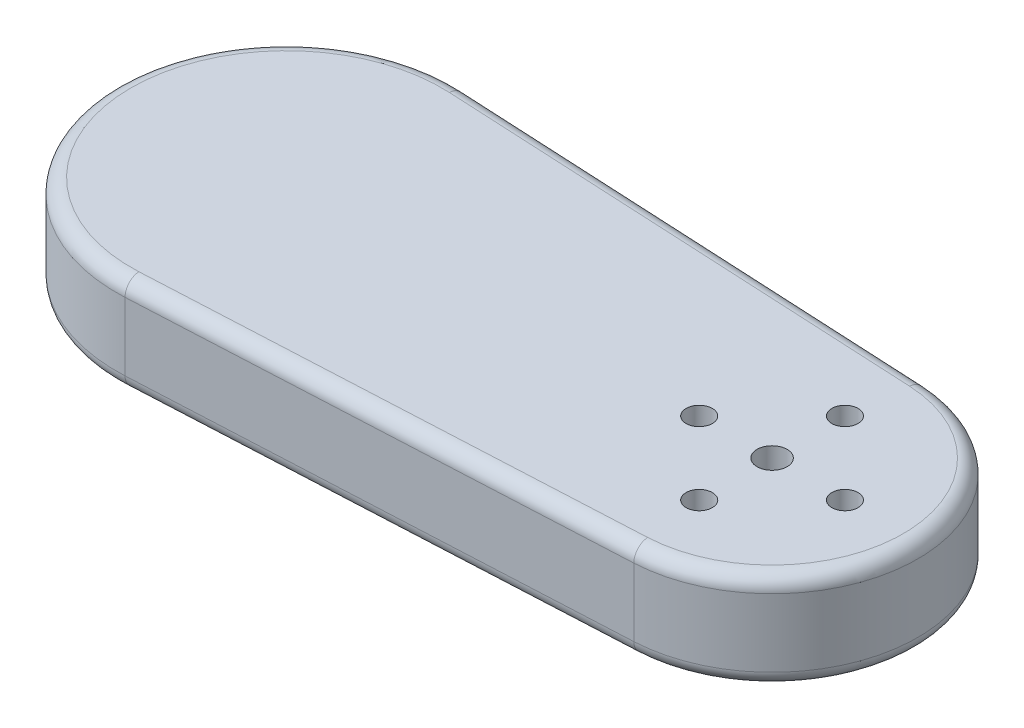
ISO-10303-21;
HEADER;
FILE_DESCRIPTION(('STEP AP214'),'2;1');
FILE_NAME('part.step','',(''),(''),'','','');
FILE_SCHEMA(('AUTOMOTIVE_DESIGN { 1 0 10303 214 1 1 1 1 }'));
ENDSEC;
DATA;
#1=APPLICATION_CONTEXT('core data for automotive mechanical design processes');
#2=APPLICATION_PROTOCOL_DEFINITION('international standard','automotive_design',2000,#1);
#3=PRODUCT_CONTEXT('',#1,'mechanical');
#4=PRODUCT('Part','Part','',(#3));
#5=PRODUCT_RELATED_PRODUCT_CATEGORY('part','',(#4));
#6=PRODUCT_DEFINITION_FORMATION('','',#4);
#7=PRODUCT_DEFINITION_CONTEXT('part definition',#1,'design');
#8=PRODUCT_DEFINITION('design','',#6,#7);
#9=PRODUCT_DEFINITION_SHAPE('','',#8);
#10=(LENGTH_UNIT() NAMED_UNIT(*) SI_UNIT(.MILLI.,.METRE.));
#11=(NAMED_UNIT(*) PLANE_ANGLE_UNIT() SI_UNIT($,.RADIAN.));
#12=(NAMED_UNIT(*) SI_UNIT($,.STERADIAN.) SOLID_ANGLE_UNIT());
#13=UNCERTAINTY_MEASURE_WITH_UNIT(LENGTH_MEASURE(1.E-05),#10,'distance_accuracy_value','');
#14=(GEOMETRIC_REPRESENTATION_CONTEXT(3) GLOBAL_UNCERTAINTY_ASSIGNED_CONTEXT((#13)) GLOBAL_UNIT_ASSIGNED_CONTEXT((#10,
#11,#12)) REPRESENTATION_CONTEXT('',''));
#15=CARTESIAN_POINT('',(0.,0.,0.));
#16=DIRECTION('',(0.,0.,1.));
#17=DIRECTION('',(1.,0.,0.));
#18=AXIS2_PLACEMENT_3D('',#15,#16,#17);
#19=CARTESIAN_POINT('',(0.,10.,0.));
#20=DIRECTION('',(0.,-1.,0.));
#21=DIRECTION('',(0.,0.,-1.));
#22=AXIS2_PLACEMENT_3D('',#19,#20,#21);
#23=CYLINDRICAL_SURFACE('',#22,14.5);
#24=CARTESIAN_POINT('',(0.,1.5,0.));
#25=DIRECTION('',(0.,1.,0.));
#26=DIRECTION('',(0.,0.,1.));
#27=AXIS2_PLACEMENT_3D('',#24,#25,#26);
#28=CIRCLE('',#27,14.5);
#29=CARTESIAN_POINT('',(0.,1.5,14.5));
#30=VERTEX_POINT('',#29);
#31=EDGE_CURVE('E11',#30,#30,#28,.F.);
#32=ORIENTED_EDGE('',*,*,#31,.T.);
#33=EDGE_LOOP('',(#32));
#34=FACE_BOUND('',#33,.T.);
#35=CARTESIAN_POINT('',(0.,7.9,0.));
#36=DIRECTION('',(0.,1.,0.));
#37=DIRECTION('',(0.,0.,1.));
#38=AXIS2_PLACEMENT_3D('',#35,#36,#37);
#39=CIRCLE('',#38,14.5);
#40=CARTESIAN_POINT('',(0.,7.9,14.5));
#41=VERTEX_POINT('',#40);
#42=EDGE_CURVE('E191',#41,#41,#39,.T.);
#43=ORIENTED_EDGE('',*,*,#42,.T.);
#44=EDGE_LOOP('',(#43));
#45=FACE_BOUND('',#44,.T.);
#46=ADVANCED_FACE('F47',(#34,#45),#23,.F.);
#47=CARTESIAN_POINT('',(0.875000000000001,10.,-17.4781113110084));
#48=DIRECTION('',(-0.0500000000000001,0.,0.998749217771909));
#49=DIRECTION('',(0.998749217771909,0.,0.0500000000000001));
#50=AXIS2_PLACEMENT_3D('',#47,#48,#49);
#51=PLANE('',#50);
#52=DIRECTION('',(0.,-1.,0.));
#53=VECTOR('',#52,1.);
#54=CARTESIAN_POINT('',(0.875000000000001,10.,-17.4781113110084));
#55=LINE('',#54,#53);
#56=CARTESIAN_POINT('',(0.875000000000001,8.5,-17.4781113110084));
#57=VERTEX_POINT('',#56);
#58=CARTESIAN_POINT('',(0.875000000000001,1.5,-17.4781113110084));
#59=VERTEX_POINT('',#58);
#60=EDGE_CURVE('E136',#57,#59,#55,.T.);
#61=ORIENTED_EDGE('',*,*,#60,.F.);
#62=DIRECTION('',(-0.998749217771909,0.,-0.0500000000000001));
#63=VECTOR('',#62,1.);
#64=CARTESIAN_POINT('',(50.75,8.5,-14.9812382665786));
#65=LINE('',#64,#63);
#66=CARTESIAN_POINT('',(50.75,8.5,-14.9812382665786));
#67=VERTEX_POINT('',#66);
#68=EDGE_CURVE('E170',#57,#67,#65,.F.);
#69=ORIENTED_EDGE('',*,*,#68,.T.);
#70=DIRECTION('',(0.,-1.,0.));
#71=VECTOR('',#70,1.);
#72=CARTESIAN_POINT('',(50.75,10.,-14.9812382665786));
#73=LINE('',#72,#71);
#74=CARTESIAN_POINT('',(50.75,1.5,-14.9812382665786));
#75=VERTEX_POINT('',#74);
#76=EDGE_CURVE('E221',#67,#75,#73,.T.);
#77=ORIENTED_EDGE('',*,*,#76,.T.);
#78=DIRECTION('',(-0.998749217771909,0.,-0.0500000000000001));
#79=VECTOR('',#78,1.);
#80=CARTESIAN_POINT('',(0.875000000000001,1.5,-17.4781113110084));
#81=LINE('',#80,#79);
#82=EDGE_CURVE('E167',#75,#59,#81,.T.);
#83=ORIENTED_EDGE('',*,*,#82,.T.);
#84=EDGE_LOOP('',(#61,#69,#77,#83));
#85=FACE_BOUND('',#84,.T.);
#86=ADVANCED_FACE('F226',(#85),#51,.F.);
#87=CARTESIAN_POINT('',(0.,10.,0.));
#88=DIRECTION('',(0.,-1.,0.));
#89=DIRECTION('',(0.,0.,-1.));
#90=AXIS2_PLACEMENT_3D('',#87,#88,#89);
#91=CYLINDRICAL_SURFACE('',#90,17.5);
#92=DIRECTION('',(0.,-1.,0.));
#93=VECTOR('',#92,1.);
#94=CARTESIAN_POINT('',(0.875000000000001,10.,17.4781113110084));
#95=LINE('',#94,#93);
#96=CARTESIAN_POINT('',(0.875000000000001,8.5,17.4781113110084));
#97=VERTEX_POINT('',#96);
#98=CARTESIAN_POINT('',(0.875000000000001,1.5,17.4781113110084));
#99=VERTEX_POINT('',#98);
#100=EDGE_CURVE('E233',#97,#99,#95,.T.);
#101=ORIENTED_EDGE('',*,*,#100,.F.);
#102=CARTESIAN_POINT('',(0.,8.5,0.));
#103=DIRECTION('',(0.,1.,0.));
#104=DIRECTION('',(0.,0.,1.));
#105=AXIS2_PLACEMENT_3D('',#102,#103,#104);
#106=CIRCLE('',#105,17.5);
#107=EDGE_CURVE('E164',#97,#57,#106,.F.);
#108=ORIENTED_EDGE('',*,*,#107,.T.);
#109=ORIENTED_EDGE('',*,*,#60,.T.);
#110=CARTESIAN_POINT('',(0.,1.5,0.));
#111=DIRECTION('',(0.,1.,0.));
#112=DIRECTION('',(0.,0.,1.));
#113=AXIS2_PLACEMENT_3D('',#110,#111,#112);
#114=CIRCLE('',#113,17.5);
#115=EDGE_CURVE('E161',#59,#99,#114,.T.);
#116=ORIENTED_EDGE('',*,*,#115,.T.);
#117=EDGE_LOOP('',(#101,#108,#109,#116));
#118=FACE_BOUND('',#117,.T.);
#119=ADVANCED_FACE('F332',(#118),#91,.T.);
#120=CARTESIAN_POINT('',(0.875000000000001,10.,17.4781113110084));
#121=DIRECTION('',(0.0500000000000001,0.,0.998749217771909));
#122=DIRECTION('',(0.998749217771909,0.,-0.0500000000000001));
#123=AXIS2_PLACEMENT_3D('',#120,#121,#122);
#124=PLANE('',#123);
#125=DIRECTION('',(0.,-1.,0.));
#126=VECTOR('',#125,1.);
#127=CARTESIAN_POINT('',(50.75,10.,14.9812382665786));
#128=LINE('',#127,#126);
#129=CARTESIAN_POINT('',(50.75,8.5,14.9812382665786));
#130=VERTEX_POINT('',#129);
#131=CARTESIAN_POINT('',(50.75,1.5,14.9812382665786));
#132=VERTEX_POINT('',#131);
#133=EDGE_CURVE('E223',#130,#132,#128,.T.);
#134=ORIENTED_EDGE('',*,*,#133,.F.);
#135=DIRECTION('',(-0.998749217771909,0.,0.0500000000000001));
#136=VECTOR('',#135,1.);
#137=CARTESIAN_POINT('',(0.875000000000001,8.5,17.4781113110084));
#138=LINE('',#137,#136);
#139=EDGE_CURVE('E158',#130,#97,#138,.T.);
#140=ORIENTED_EDGE('',*,*,#139,.T.);
#141=ORIENTED_EDGE('',*,*,#100,.T.);
#142=DIRECTION('',(-0.998749217771909,0.,0.0500000000000001));
#143=VECTOR('',#142,1.);
#144=CARTESIAN_POINT('',(50.75,1.5,14.9812382665786));
#145=LINE('',#144,#143);
#146=EDGE_CURVE('E155',#99,#132,#145,.F.);
#147=ORIENTED_EDGE('',*,*,#146,.T.);
#148=EDGE_LOOP('',(#134,#140,#141,#147));
#149=FACE_BOUND('',#148,.T.);
#150=ADVANCED_FACE('F256',(#149),#124,.T.);
#151=CARTESIAN_POINT('',(57.5,10.,0.));
#152=DIRECTION('',(0.,-1.,0.));
#153=DIRECTION('',(0.,0.,-1.));
#154=AXIS2_PLACEMENT_3D('',#151,#152,#153);
#155=CYLINDRICAL_SURFACE('',#154,1.35000000000001);
#156=CARTESIAN_POINT('',(57.5,10.,0.));
#157=DIRECTION('',(0.,1.,0.));
#158=DIRECTION('',(0.,0.,1.));
#159=AXIS2_PLACEMENT_3D('',#156,#157,#158);
#160=CIRCLE('',#159,1.35000000000001);
#161=CARTESIAN_POINT('',(57.5,10.,1.35000000000001));
#162=VERTEX_POINT('',#161);
#163=EDGE_CURVE('E229',#162,#162,#160,.T.);
#164=ORIENTED_EDGE('',*,*,#163,.T.);
#165=EDGE_LOOP('',(#164));
#166=FACE_BOUND('',#165,.T.);
#167=CARTESIAN_POINT('',(57.5,0.,0.));
#168=DIRECTION('',(0.,1.,0.));
#169=DIRECTION('',(0.,0.,1.));
#170=AXIS2_PLACEMENT_3D('',#167,#168,#169);
#171=CIRCLE('',#170,1.35000000000001);
#172=CARTESIAN_POINT('',(57.5,0.,1.35000000000001));
#173=VERTEX_POINT('',#172);
#174=EDGE_CURVE('E239',#173,#173,#171,.T.);
#175=ORIENTED_EDGE('',*,*,#174,.F.);
#176=EDGE_LOOP('',(#175));
#177=FACE_BOUND('',#176,.T.);
#178=ADVANCED_FACE('F335',(#166,#177),#155,.F.);
#179=CARTESIAN_POINT('',(50.,10.,7.5));
#180=DIRECTION('',(0.,-1.,0.));
#181=DIRECTION('',(0.,0.,-1.));
#182=AXIS2_PLACEMENT_3D('',#179,#180,#181);
#183=CYLINDRICAL_SURFACE('',#182,1.35000000000001);
#184=CARTESIAN_POINT('',(50.,10.,7.5));
#185=DIRECTION('',(0.,1.,0.));
#186=DIRECTION('',(0.,0.,1.));
#187=AXIS2_PLACEMENT_3D('',#184,#185,#186);
#188=CIRCLE('',#187,1.35000000000001);
#189=CARTESIAN_POINT('',(50.,10.,8.85));
#190=VERTEX_POINT('',#189);
#191=EDGE_CURVE('E236',#190,#190,#188,.T.);
#192=ORIENTED_EDGE('',*,*,#191,.T.);
#193=EDGE_LOOP('',(#192));
#194=FACE_BOUND('',#193,.T.);
#195=CARTESIAN_POINT('',(50.,0.,7.5));
#196=DIRECTION('',(0.,1.,0.));
#197=DIRECTION('',(0.,0.,1.));
#198=AXIS2_PLACEMENT_3D('',#195,#196,#197);
#199=CIRCLE('',#198,1.35000000000001);
#200=CARTESIAN_POINT('',(50.,0.,8.85));
#201=VERTEX_POINT('',#200);
#202=EDGE_CURVE('E285',#201,#201,#199,.T.);
#203=ORIENTED_EDGE('',*,*,#202,.F.);
#204=EDGE_LOOP('',(#203));
#205=FACE_BOUND('',#204,.T.);
#206=ADVANCED_FACE('F338',(#194,#205),#183,.F.);
#207=CARTESIAN_POINT('',(50.,10.,-7.5));
#208=DIRECTION('',(0.,-1.,0.));
#209=DIRECTION('',(0.,0.,-1.));
#210=AXIS2_PLACEMENT_3D('',#207,#208,#209);
#211=CYLINDRICAL_SURFACE('',#210,1.35000000000001);
#212=CARTESIAN_POINT('',(50.,10.,-7.5));
#213=DIRECTION('',(0.,1.,0.));
#214=DIRECTION('',(0.,0.,1.));
#215=AXIS2_PLACEMENT_3D('',#212,#213,#214);
#216=CIRCLE('',#215,1.35000000000001);
#217=CARTESIAN_POINT('',(50.,10.,-6.14999999999999));
#218=VERTEX_POINT('',#217);
#219=EDGE_CURVE('E306',#218,#218,#216,.T.);
#220=ORIENTED_EDGE('',*,*,#219,.T.);
#221=EDGE_LOOP('',(#220));
#222=FACE_BOUND('',#221,.T.);
#223=CARTESIAN_POINT('',(50.,0.,-7.5));
#224=DIRECTION('',(0.,1.,0.));
#225=DIRECTION('',(0.,0.,1.));
#226=AXIS2_PLACEMENT_3D('',#223,#224,#225);
#227=CIRCLE('',#226,1.35000000000001);
#228=CARTESIAN_POINT('',(50.,0.,-6.14999999999999));
#229=VERTEX_POINT('',#228);
#230=EDGE_CURVE('E281',#229,#229,#227,.T.);
#231=ORIENTED_EDGE('',*,*,#230,.F.);
#232=EDGE_LOOP('',(#231));
#233=FACE_BOUND('',#232,.T.);
#234=ADVANCED_FACE('F342',(#222,#233),#211,.F.);
#235=CARTESIAN_POINT('',(50.,10.,0.));
#236=DIRECTION('',(0.,-1.,0.));
#237=DIRECTION('',(0.,0.,-1.));
#238=AXIS2_PLACEMENT_3D('',#235,#236,#237);
#239=CYLINDRICAL_SURFACE('',#238,1.54999999999999);
#240=CARTESIAN_POINT('',(50.,10.,0.));
#241=DIRECTION('',(0.,1.,0.));
#242=DIRECTION('',(0.,0.,1.));
#243=AXIS2_PLACEMENT_3D('',#240,#241,#242);
#244=CIRCLE('',#243,1.54999999999999);
#245=CARTESIAN_POINT('',(50.,10.,1.54999999999999));
#246=VERTEX_POINT('',#245);
#247=EDGE_CURVE('E294',#246,#246,#244,.T.);
#248=ORIENTED_EDGE('',*,*,#247,.T.);
#249=EDGE_LOOP('',(#248));
#250=FACE_BOUND('',#249,.T.);
#251=CARTESIAN_POINT('',(50.,0.,0.));
#252=DIRECTION('',(0.,1.,0.));
#253=DIRECTION('',(0.,0.,1.));
#254=AXIS2_PLACEMENT_3D('',#251,#252,#253);
#255=CIRCLE('',#254,1.54999999999999);
#256=CARTESIAN_POINT('',(50.,0.,1.54999999999999));
#257=VERTEX_POINT('',#256);
#258=EDGE_CURVE('E277',#257,#257,#255,.T.);
#259=ORIENTED_EDGE('',*,*,#258,.F.);
#260=EDGE_LOOP('',(#259));
#261=FACE_BOUND('',#260,.T.);
#262=ADVANCED_FACE('F346',(#250,#261),#239,.F.);
#263=CARTESIAN_POINT('',(42.5,10.,0.));
#264=DIRECTION('',(0.,-1.,0.));
#265=DIRECTION('',(0.,0.,-1.));
#266=AXIS2_PLACEMENT_3D('',#263,#264,#265);
#267=CYLINDRICAL_SURFACE('',#266,1.35000000000001);
#268=CARTESIAN_POINT('',(42.5,10.,0.));
#269=DIRECTION('',(0.,1.,0.));
#270=DIRECTION('',(0.,0.,1.));
#271=AXIS2_PLACEMENT_3D('',#268,#269,#270);
#272=CIRCLE('',#271,1.35000000000001);
#273=CARTESIAN_POINT('',(42.5,10.,1.35000000000001));
#274=VERTEX_POINT('',#273);
#275=EDGE_CURVE('E290',#274,#274,#272,.T.);
#276=ORIENTED_EDGE('',*,*,#275,.T.);
#277=EDGE_LOOP('',(#276));
#278=FACE_BOUND('',#277,.T.);
#279=CARTESIAN_POINT('',(42.5,0.,0.));
#280=DIRECTION('',(0.,1.,0.));
#281=DIRECTION('',(0.,0.,1.));
#282=AXIS2_PLACEMENT_3D('',#279,#280,#281);
#283=CIRCLE('',#282,1.35000000000001);
#284=CARTESIAN_POINT('',(42.5,0.,1.35000000000001));
#285=VERTEX_POINT('',#284);
#286=EDGE_CURVE('E273',#285,#285,#283,.T.);
#287=ORIENTED_EDGE('',*,*,#286,.F.);
#288=EDGE_LOOP('',(#287));
#289=FACE_BOUND('',#288,.T.);
#290=ADVANCED_FACE('F350',(#278,#289),#267,.F.);
#291=CARTESIAN_POINT('',(50.,10.,0.));
#292=DIRECTION('',(0.,-1.,0.));
#293=DIRECTION('',(0.,0.,-1.));
#294=AXIS2_PLACEMENT_3D('',#291,#292,#293);
#295=CYLINDRICAL_SURFACE('',#294,15.);
#296=ORIENTED_EDGE('',*,*,#76,.F.);
#297=CARTESIAN_POINT('',(50.,8.5,0.));
#298=DIRECTION('',(0.,1.,0.));
#299=DIRECTION('',(0.,0.,1.));
#300=AXIS2_PLACEMENT_3D('',#297,#298,#299);
#301=CIRCLE('',#300,15.);
#302=EDGE_CURVE('E121',#67,#130,#301,.F.);
#303=ORIENTED_EDGE('',*,*,#302,.T.);
#304=ORIENTED_EDGE('',*,*,#133,.T.);
#305=CARTESIAN_POINT('',(50.,1.5,0.));
#306=DIRECTION('',(0.,1.,0.));
#307=DIRECTION('',(0.,0.,1.));
#308=AXIS2_PLACEMENT_3D('',#305,#306,#307);
#309=CIRCLE('',#308,15.);
#310=EDGE_CURVE('E144',#132,#75,#309,.T.);
#311=ORIENTED_EDGE('',*,*,#310,.T.);
#312=EDGE_LOOP('',(#296,#303,#304,#311));
#313=FACE_BOUND('',#312,.T.);
#314=ADVANCED_FACE('F220',(#313),#295,.T.);
#315=CARTESIAN_POINT('',(0.,10.,0.));
#316=DIRECTION('',(0.,1.,0.));
#317=DIRECTION('',(0.,0.,1.));
#318=AXIS2_PLACEMENT_3D('',#315,#316,#317);
#319=PLANE('',#318);
#320=DIRECTION('',(-0.998749217771909,0.,0.0500000000000001));
#321=VECTOR('',#320,1.);
#322=CARTESIAN_POINT('',(0.800000000000001,10.,15.9799874843505));
#323=LINE('',#322,#321);
#324=CARTESIAN_POINT('',(0.800000000000001,10.,15.9799874843505));
#325=VERTEX_POINT('',#324);
#326=CARTESIAN_POINT('',(50.675,10.,13.4831144399208));
#327=VERTEX_POINT('',#326);
#328=EDGE_CURVE('E141',#325,#327,#323,.F.);
#329=ORIENTED_EDGE('',*,*,#328,.T.);
#330=CARTESIAN_POINT('',(50.,10.,0.));
#331=DIRECTION('',(0.,1.,0.));
#332=DIRECTION('',(0.,0.,1.));
#333=AXIS2_PLACEMENT_3D('',#330,#331,#332);
#334=CIRCLE('',#333,13.5);
#335=CARTESIAN_POINT('',(50.675,10.,-13.4831144399208));
#336=VERTEX_POINT('',#335);
#337=EDGE_CURVE('E119',#327,#336,#334,.T.);
#338=ORIENTED_EDGE('',*,*,#337,.T.);
#339=DIRECTION('',(-0.998749217771909,0.,-0.0500000000000001));
#340=VECTOR('',#339,1.);
#341=CARTESIAN_POINT('',(0.800000000000001,10.,-15.9799874843505));
#342=LINE('',#341,#340);
#343=CARTESIAN_POINT('',(0.800000000000001,10.,-15.9799874843505));
#344=VERTEX_POINT('',#343);
#345=EDGE_CURVE('E128',#336,#344,#342,.T.);
#346=ORIENTED_EDGE('',*,*,#345,.T.);
#347=CARTESIAN_POINT('',(0.,10.,0.));
#348=DIRECTION('',(0.,1.,0.));
#349=DIRECTION('',(0.,0.,1.));
#350=AXIS2_PLACEMENT_3D('',#347,#348,#349);
#351=CIRCLE('',#350,16.);
#352=EDGE_CURVE('E135',#344,#325,#351,.T.);
#353=ORIENTED_EDGE('',*,*,#352,.T.);
#354=EDGE_LOOP('',(#329,#338,#346,#353));
#355=FACE_BOUND('',#354,.T.);
#356=ORIENTED_EDGE('',*,*,#275,.F.);
#357=EDGE_LOOP('',(#356));
#358=FACE_BOUND('',#357,.T.);
#359=ORIENTED_EDGE('',*,*,#247,.F.);
#360=EDGE_LOOP('',(#359));
#361=FACE_BOUND('',#360,.T.);
#362=ORIENTED_EDGE('',*,*,#219,.F.);
#363=EDGE_LOOP('',(#362));
#364=FACE_BOUND('',#363,.T.);
#365=ORIENTED_EDGE('',*,*,#191,.F.);
#366=EDGE_LOOP('',(#365));
#367=FACE_BOUND('',#366,.T.);
#368=ORIENTED_EDGE('',*,*,#163,.F.);
#369=EDGE_LOOP('',(#368));
#370=FACE_BOUND('',#369,.T.);
#371=ADVANCED_FACE('F138',(#355,#358,#361,#364,#367,#370),#319,.T.);
#372=CARTESIAN_POINT('',(0.,0.,0.));
#373=DIRECTION('',(0.,1.,0.));
#374=DIRECTION('',(0.,0.,1.));
#375=AXIS2_PLACEMENT_3D('',#372,#373,#374);
#376=PLANE('',#375);
#377=CARTESIAN_POINT('',(50.,0.,0.));
#378=DIRECTION('',(0.,1.,0.));
#379=DIRECTION('',(0.,0.,1.));
#380=AXIS2_PLACEMENT_3D('',#377,#378,#379);
#381=CIRCLE('',#380,13.5);
#382=CARTESIAN_POINT('',(50.675,0.,-13.4831144399208));
#383=VERTEX_POINT('',#382);
#384=CARTESIAN_POINT('',(50.675,0.,13.4831144399208));
#385=VERTEX_POINT('',#384);
#386=EDGE_CURVE('E69',#383,#385,#381,.F.);
#387=ORIENTED_EDGE('',*,*,#386,.T.);
#388=DIRECTION('',(-0.998749217771909,0.,0.0500000000000001));
#389=VECTOR('',#388,1.);
#390=CARTESIAN_POINT('',(0.800000000000001,0.,15.9799874843505));
#391=LINE('',#390,#389);
#392=CARTESIAN_POINT('',(0.800000000000001,0.,15.9799874843506));
#393=VERTEX_POINT('',#392);
#394=EDGE_CURVE('E57',#385,#393,#391,.T.);
#395=ORIENTED_EDGE('',*,*,#394,.T.);
#396=CARTESIAN_POINT('',(0.,0.,0.));
#397=DIRECTION('',(0.,1.,0.));
#398=DIRECTION('',(0.,0.,1.));
#399=AXIS2_PLACEMENT_3D('',#396,#397,#398);
#400=CIRCLE('',#399,16.);
#401=CARTESIAN_POINT('',(0.800000000000001,0.,-15.9799874843505));
#402=VERTEX_POINT('',#401);
#403=EDGE_CURVE('E178',#393,#402,#400,.T.);
#404=ORIENTED_EDGE('',*,*,#403,.T.);
#405=DIRECTION('',(-0.998749217771909,0.,-0.0500000000000001));
#406=VECTOR('',#405,1.);
#407=CARTESIAN_POINT('',(0.800000000000001,0.,-15.9799874843505));
#408=LINE('',#407,#406);
#409=EDGE_CURVE('E173',#402,#383,#408,.F.);
#410=ORIENTED_EDGE('',*,*,#409,.T.);
#411=EDGE_LOOP('',(#387,#395,#404,#410));
#412=FACE_BOUND('',#411,.T.);
#413=ORIENTED_EDGE('',*,*,#286,.T.);
#414=EDGE_LOOP('',(#413));
#415=FACE_BOUND('',#414,.T.);
#416=ORIENTED_EDGE('',*,*,#258,.T.);
#417=EDGE_LOOP('',(#416));
#418=FACE_BOUND('',#417,.T.);
#419=ORIENTED_EDGE('',*,*,#230,.T.);
#420=EDGE_LOOP('',(#419));
#421=FACE_BOUND('',#420,.T.);
#422=ORIENTED_EDGE('',*,*,#202,.T.);
#423=EDGE_LOOP('',(#422));
#424=FACE_BOUND('',#423,.T.);
#425=ORIENTED_EDGE('',*,*,#174,.T.);
#426=EDGE_LOOP('',(#425));
#427=FACE_BOUND('',#426,.T.);
#428=ADVANCED_FACE('F265',(#412,#415,#418,#421,#424,#427),#376,.F.);
#429=CARTESIAN_POINT('',(0.,7.9,0.));
#430=DIRECTION('',(0.,1.,0.));
#431=DIRECTION('',(0.,0.,1.));
#432=AXIS2_PLACEMENT_3D('',#429,#430,#431);
#433=PLANE('',#432);
#434=ORIENTED_EDGE('',*,*,#42,.F.);
#435=EDGE_LOOP('',(#434));
#436=FACE_BOUND('',#435,.T.);
#437=ADVANCED_FACE('F268',(#436),#433,.F.);
#438=CARTESIAN_POINT('',(0.,8.5,0.));
#439=DIRECTION('',(0.,1.,0.));
#440=DIRECTION('',(0.,0.,1.));
#441=AXIS2_PLACEMENT_3D('',#438,#439,#440);
#442=TOROIDAL_SURFACE('',#441,16.,1.5);
#443=CARTESIAN_POINT('',(0.800000000000001,8.5,-15.9799874843505));
#444=DIRECTION('',(0.998749217771909,0.,0.05));
#445=DIRECTION('',(0.05,0.,-0.998749217771909));
#446=AXIS2_PLACEMENT_3D('',#443,#444,#445);
#447=CIRCLE('',#446,1.5);
#448=EDGE_CURVE('E131',#57,#344,#447,.T.);
#449=ORIENTED_EDGE('',*,*,#448,.F.);
#450=ORIENTED_EDGE('',*,*,#107,.F.);
#451=CARTESIAN_POINT('',(0.800000000000001,8.5,15.9799874843505));
#452=DIRECTION('',(0.998749217771909,0.,-0.05));
#453=DIRECTION('',(-0.05,0.,-0.998749217771909));
#454=AXIS2_PLACEMENT_3D('',#451,#452,#453);
#455=CIRCLE('',#454,1.5);
#456=EDGE_CURVE('E187',#325,#97,#455,.T.);
#457=ORIENTED_EDGE('',*,*,#456,.F.);
#458=ORIENTED_EDGE('',*,*,#352,.F.);
#459=EDGE_LOOP('',(#449,#450,#457,#458));
#460=FACE_BOUND('',#459,.T.);
#461=ADVANCED_FACE('F250',(#460),#442,.T.);
#462=CARTESIAN_POINT('',(0.800000000000001,8.5,15.9799874843505));
#463=DIRECTION('',(-0.998749217771909,0.,0.0500000000000001));
#464=DIRECTION('',(0.0500000000000001,0.,0.998749217771909));
#465=AXIS2_PLACEMENT_3D('',#462,#463,#464);
#466=CYLINDRICAL_SURFACE('',#465,1.5);
#467=ORIENTED_EDGE('',*,*,#456,.T.);
#468=ORIENTED_EDGE('',*,*,#139,.F.);
#469=CARTESIAN_POINT('',(50.675,8.5,13.4831144399208));
#470=DIRECTION('',(0.998749217771909,0.,-0.0499999999999991));
#471=DIRECTION('',(-0.0499999999999991,0.,-0.998749217771909));
#472=AXIS2_PLACEMENT_3D('',#469,#470,#471);
#473=CIRCLE('',#472,1.5);
#474=EDGE_CURVE('E125',#327,#130,#473,.T.);
#475=ORIENTED_EDGE('',*,*,#474,.F.);
#476=ORIENTED_EDGE('',*,*,#328,.F.);
#477=EDGE_LOOP('',(#467,#468,#475,#476));
#478=FACE_BOUND('',#477,.T.);
#479=ADVANCED_FACE('F253',(#478),#466,.T.);
#480=CARTESIAN_POINT('',(0.800000000000001,8.5,-15.9799874843505));
#481=DIRECTION('',(0.998749217771909,0.,0.0500000000000001));
#482=DIRECTION('',(0.0500000000000001,0.,-0.998749217771909));
#483=AXIS2_PLACEMENT_3D('',#480,#481,#482);
#484=CYLINDRICAL_SURFACE('',#483,1.5);
#485=ORIENTED_EDGE('',*,*,#448,.T.);
#486=ORIENTED_EDGE('',*,*,#345,.F.);
#487=CARTESIAN_POINT('',(50.675,8.5,-13.4831144399208));
#488=DIRECTION('',(0.998749217771909,0.,0.0499999999999991));
#489=DIRECTION('',(0.0499999999999991,0.,-0.998749217771909));
#490=AXIS2_PLACEMENT_3D('',#487,#488,#489);
#491=CIRCLE('',#490,1.5);
#492=EDGE_CURVE('E115',#67,#336,#491,.T.);
#493=ORIENTED_EDGE('',*,*,#492,.F.);
#494=ORIENTED_EDGE('',*,*,#68,.F.);
#495=EDGE_LOOP('',(#485,#486,#493,#494));
#496=FACE_BOUND('',#495,.T.);
#497=ADVANCED_FACE('F129',(#496),#484,.T.);
#498=CARTESIAN_POINT('',(50.,8.5,0.));
#499=DIRECTION('',(0.,1.,0.));
#500=DIRECTION('',(0.,0.,1.));
#501=AXIS2_PLACEMENT_3D('',#498,#499,#500);
#502=TOROIDAL_SURFACE('',#501,13.5,1.5);
#503=ORIENTED_EDGE('',*,*,#474,.T.);
#504=ORIENTED_EDGE('',*,*,#302,.F.);
#505=ORIENTED_EDGE('',*,*,#492,.T.);
#506=ORIENTED_EDGE('',*,*,#337,.F.);
#507=EDGE_LOOP('',(#503,#504,#505,#506));
#508=FACE_BOUND('',#507,.T.);
#509=ADVANCED_FACE('F117',(#508),#502,.T.);
#510=CARTESIAN_POINT('',(50.,1.5,0.));
#511=DIRECTION('',(0.,1.,0.));
#512=DIRECTION('',(0.,0.,1.));
#513=AXIS2_PLACEMENT_3D('',#510,#511,#512);
#514=TOROIDAL_SURFACE('',#513,13.5,1.5);
#515=CARTESIAN_POINT('',(50.675,1.5,13.4831144399208));
#516=DIRECTION('',(-0.998749217771909,0.,0.0499999999999992));
#517=DIRECTION('',(0.0499999999999992,0.,0.998749217771909));
#518=AXIS2_PLACEMENT_3D('',#515,#516,#517);
#519=CIRCLE('',#518,1.5);
#520=EDGE_CURVE('E202',#385,#132,#519,.T.);
#521=ORIENTED_EDGE('',*,*,#520,.F.);
#522=ORIENTED_EDGE('',*,*,#386,.F.);
#523=CARTESIAN_POINT('',(50.675,1.5,-13.4831144399208));
#524=DIRECTION('',(-0.998749217771909,0.,-0.0499999999999991));
#525=DIRECTION('',(-0.0499999999999991,0.,0.998749217771909));
#526=AXIS2_PLACEMENT_3D('',#523,#524,#525);
#527=CIRCLE('',#526,1.5);
#528=EDGE_CURVE('E51',#75,#383,#527,.T.);
#529=ORIENTED_EDGE('',*,*,#528,.F.);
#530=ORIENTED_EDGE('',*,*,#310,.F.);
#531=EDGE_LOOP('',(#521,#522,#529,#530));
#532=FACE_BOUND('',#531,.T.);
#533=ADVANCED_FACE('F49',(#532),#514,.T.);
#534=CARTESIAN_POINT('',(0.800000000000001,1.5,-15.9799874843505));
#535=DIRECTION('',(-0.998749217771909,0.,-0.0500000000000001));
#536=DIRECTION('',(-0.0500000000000001,0.,0.998749217771909));
#537=AXIS2_PLACEMENT_3D('',#534,#535,#536);
#538=CYLINDRICAL_SURFACE('',#537,1.5);
#539=ORIENTED_EDGE('',*,*,#528,.T.);
#540=ORIENTED_EDGE('',*,*,#409,.F.);
#541=CARTESIAN_POINT('',(0.8,1.5,-15.9799874843505));
#542=DIRECTION('',(-0.998749217771909,0.,-0.05));
#543=DIRECTION('',(-0.05,0.,0.998749217771909));
#544=AXIS2_PLACEMENT_3D('',#541,#542,#543);
#545=CIRCLE('',#544,1.5);
#546=EDGE_CURVE('E199',#59,#402,#545,.T.);
#547=ORIENTED_EDGE('',*,*,#546,.F.);
#548=ORIENTED_EDGE('',*,*,#82,.F.);
#549=EDGE_LOOP('',(#539,#540,#547,#548));
#550=FACE_BOUND('',#549,.T.);
#551=ADVANCED_FACE('F212',(#550),#538,.T.);
#552=CARTESIAN_POINT('',(0.800000000000001,1.5,15.9799874843505));
#553=DIRECTION('',(0.998749217771909,0.,-0.0500000000000001));
#554=DIRECTION('',(-0.0500000000000001,0.,-0.998749217771909));
#555=AXIS2_PLACEMENT_3D('',#552,#553,#554);
#556=CYLINDRICAL_SURFACE('',#555,1.5);
#557=ORIENTED_EDGE('',*,*,#520,.T.);
#558=ORIENTED_EDGE('',*,*,#146,.F.);
#559=CARTESIAN_POINT('',(0.800000000000001,1.5,15.9799874843505));
#560=DIRECTION('',(-0.998749217771909,0.,0.05));
#561=DIRECTION('',(0.05,0.,0.998749217771909));
#562=AXIS2_PLACEMENT_3D('',#559,#560,#561);
#563=CIRCLE('',#562,1.5);
#564=EDGE_CURVE('E195',#393,#99,#563,.T.);
#565=ORIENTED_EDGE('',*,*,#564,.F.);
#566=ORIENTED_EDGE('',*,*,#394,.F.);
#567=EDGE_LOOP('',(#557,#558,#565,#566));
#568=FACE_BOUND('',#567,.T.);
#569=ADVANCED_FACE('F257',(#568),#556,.T.);
#570=CARTESIAN_POINT('',(0.,1.5,0.));
#571=DIRECTION('',(0.,1.,0.));
#572=DIRECTION('',(0.,0.,1.));
#573=AXIS2_PLACEMENT_3D('',#570,#571,#572);
#574=TOROIDAL_SURFACE('',#573,16.,1.5);
#575=CARTESIAN_POINT('',(0.,0.,0.));
#576=DIRECTION('',(0.,1.,0.));
#577=DIRECTION('',(0.,0.,1.));
#578=AXIS2_PLACEMENT_3D('',#575,#576,#577);
#579=CIRCLE('',#578,16.);
#580=EDGE_CURVE('E192',#393,#402,#579,.F.);
#581=ORIENTED_EDGE('',*,*,#580,.F.);
#582=ORIENTED_EDGE('',*,*,#564,.T.);
#583=ORIENTED_EDGE('',*,*,#115,.F.);
#584=ORIENTED_EDGE('',*,*,#546,.T.);
#585=EDGE_LOOP('',(#581,#582,#583,#584));
#586=FACE_BOUND('',#585,.T.);
#587=ADVANCED_FACE('F261',(#586),#574,.T.);
#588=CARTESIAN_POINT('',(0.,1.5,0.));
#589=DIRECTION('',(0.,1.,0.));
#590=DIRECTION('',(0.,0.,1.));
#591=AXIS2_PLACEMENT_3D('',#588,#589,#590);
#592=TOROIDAL_SURFACE('',#591,16.,1.5);
#593=ORIENTED_EDGE('',*,*,#31,.F.);
#594=EDGE_LOOP('',(#593));
#595=FACE_BOUND('',#594,.T.);
#596=ORIENTED_EDGE('',*,*,#403,.F.);
#597=ORIENTED_EDGE('',*,*,#580,.T.);
#598=EDGE_LOOP('',(#596,#597));
#599=FACE_BOUND('',#598,.T.);
#600=ADVANCED_FACE('F264',(#595,#599),#592,.T.);
#601=CLOSED_SHELL('',(#46,#86,#119,#150,#178,#206,#234,#262,#290,#314,#371,#428,#437,#461,#479,
#497,#509,#533,#551,#569,#587,#600));
#602=MANIFOLD_SOLID_BREP('B2',#601);
#603=ADVANCED_BREP_SHAPE_REPRESENTATION('',(#18,#602),#14);
#604=SHAPE_DEFINITION_REPRESENTATION(#9,#603);
ENDSEC;
END-ISO-10303-21;
